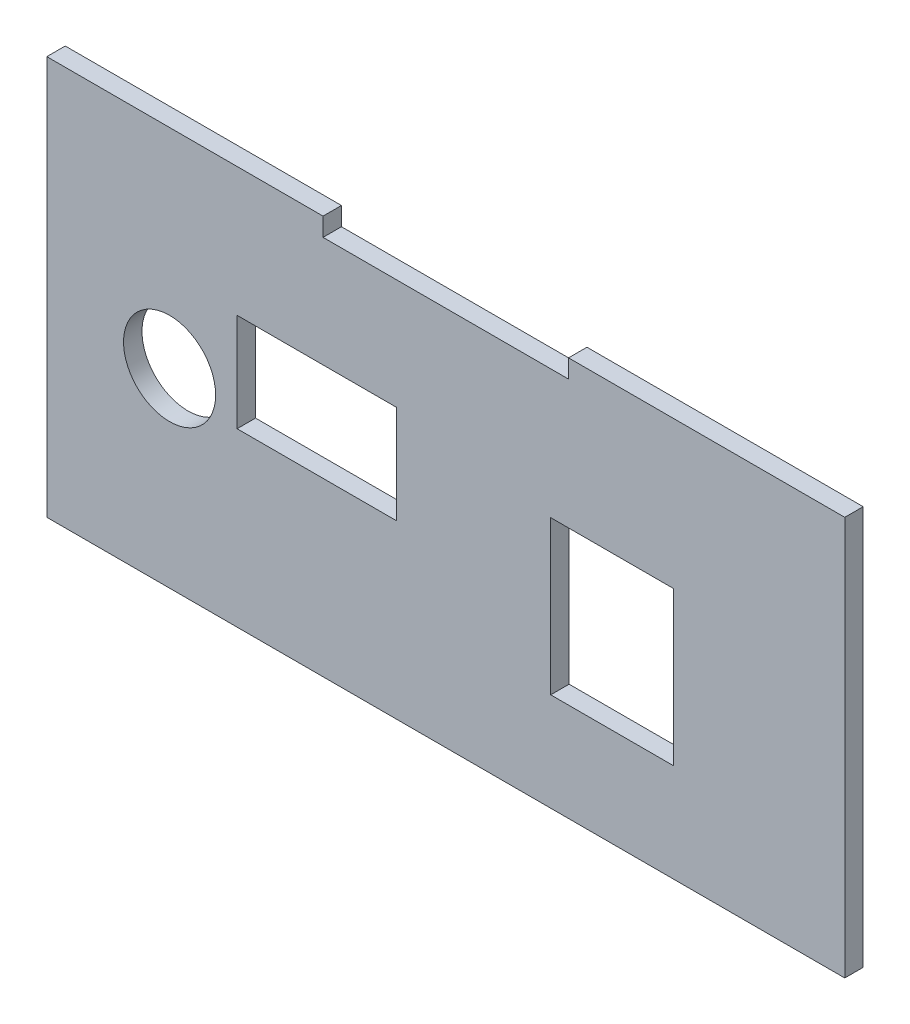
ISO-10303-21;
HEADER;
FILE_DESCRIPTION(('STEP AP214'),'2;1');
FILE_NAME('part.step','',(''),(''),'','','');
FILE_SCHEMA(('AUTOMOTIVE_DESIGN { 1 0 10303 214 1 1 1 1 }'));
ENDSEC;
DATA;
#1=APPLICATION_CONTEXT('core data for automotive mechanical design processes');
#2=APPLICATION_PROTOCOL_DEFINITION('international standard','automotive_design',2000,#1);
#3=PRODUCT_CONTEXT('',#1,'mechanical');
#4=PRODUCT('Part','Part','',(#3));
#5=PRODUCT_RELATED_PRODUCT_CATEGORY('part','',(#4));
#6=PRODUCT_DEFINITION_FORMATION('','',#4);
#7=PRODUCT_DEFINITION_CONTEXT('part definition',#1,'design');
#8=PRODUCT_DEFINITION('design','',#6,#7);
#9=PRODUCT_DEFINITION_SHAPE('','',#8);
#10=(LENGTH_UNIT() NAMED_UNIT(*) SI_UNIT(.MILLI.,.METRE.));
#11=(NAMED_UNIT(*) PLANE_ANGLE_UNIT() SI_UNIT($,.RADIAN.));
#12=(NAMED_UNIT(*) SI_UNIT($,.STERADIAN.) SOLID_ANGLE_UNIT());
#13=UNCERTAINTY_MEASURE_WITH_UNIT(LENGTH_MEASURE(1.E-05),#10,'distance_accuracy_value','');
#14=(GEOMETRIC_REPRESENTATION_CONTEXT(3) GLOBAL_UNCERTAINTY_ASSIGNED_CONTEXT((#13)) GLOBAL_UNIT_ASSIGNED_CONTEXT((#10,
#11,#12)) REPRESENTATION_CONTEXT('',''));
#15=CARTESIAN_POINT('',(0.,0.,0.));
#16=DIRECTION('',(0.,0.,1.));
#17=DIRECTION('',(1.,0.,0.));
#18=AXIS2_PLACEMENT_3D('',#15,#16,#17);
#19=CARTESIAN_POINT('',(0.,28.0440847360638,-3.));
#20=DIRECTION('',(0.,-1.,0.));
#21=DIRECTION('',(0.,0.,-1.));
#22=AXIS2_PLACEMENT_3D('',#19,#20,#21);
#23=PLANE('',#22);
#24=DIRECTION('',(1.,0.,0.));
#25=VECTOR('',#24,1.);
#26=CARTESIAN_POINT('',(0.,28.0440847360638,0.));
#27=LINE('',#26,#25);
#28=CARTESIAN_POINT('',(-64.0471321839935,28.0440847360638,0.));
#29=VERTEX_POINT('',#28);
#30=CARTESIAN_POINT('',(-38.0471321839935,28.0440847360638,0.));
#31=VERTEX_POINT('',#30);
#32=EDGE_CURVE('E239',#29,#31,#27,.T.);
#33=ORIENTED_EDGE('',*,*,#32,.F.);
#34=DIRECTION('',(0.,0.,1.));
#35=VECTOR('',#34,1.);
#36=CARTESIAN_POINT('',(-64.0471321839935,28.0440847360638,-3.));
#37=LINE('',#36,#35);
#38=CARTESIAN_POINT('',(-64.0471321839935,28.0440847360638,-3.));
#39=VERTEX_POINT('',#38);
#40=EDGE_CURVE('E11',#39,#29,#37,.T.);
#41=ORIENTED_EDGE('',*,*,#40,.F.);
#42=DIRECTION('',(1.,0.,0.));
#43=VECTOR('',#42,1.);
#44=CARTESIAN_POINT('',(0.,28.0440847360638,-3.));
#45=LINE('',#44,#43);
#46=CARTESIAN_POINT('',(-38.0471321839935,28.0440847360638,-3.));
#47=VERTEX_POINT('',#46);
#48=EDGE_CURVE('E182',#39,#47,#45,.T.);
#49=ORIENTED_EDGE('',*,*,#48,.T.);
#50=DIRECTION('',(0.,0.,1.));
#51=VECTOR('',#50,1.);
#52=CARTESIAN_POINT('',(-38.0471321839935,28.0440847360638,-3.));
#53=LINE('',#52,#51);
#54=EDGE_CURVE('E178',#47,#31,#53,.T.);
#55=ORIENTED_EDGE('',*,*,#54,.T.);
#56=EDGE_LOOP('',(#33,#41,#49,#55));
#57=FACE_BOUND('',#56,.T.);
#58=ADVANCED_FACE('F39',(#57),#23,.T.);
#59=CARTESIAN_POINT('',(-64.0471321839935,0.,-3.));
#60=DIRECTION('',(-1.,0.,0.));
#61=DIRECTION('',(0.,0.,1.));
#62=AXIS2_PLACEMENT_3D('',#59,#60,#61);
#63=PLANE('',#62);
#64=DIRECTION('',(0.,-1.,0.));
#65=VECTOR('',#64,1.);
#66=CARTESIAN_POINT('',(-64.0471321839935,0.,0.));
#67=LINE('',#66,#65);
#68=CARTESIAN_POINT('',(-64.0471321839935,12.0440847360638,0.));
#69=VERTEX_POINT('',#68);
#70=EDGE_CURVE('E248',#29,#69,#67,.T.);
#71=ORIENTED_EDGE('',*,*,#70,.T.);
#72=DIRECTION('',(0.,0.,1.));
#73=VECTOR('',#72,1.);
#74=CARTESIAN_POINT('',(-64.0471321839935,12.0440847360638,-3.));
#75=LINE('',#74,#73);
#76=CARTESIAN_POINT('',(-64.0471321839935,12.0440847360638,-3.));
#77=VERTEX_POINT('',#76);
#78=EDGE_CURVE('E50',#77,#69,#75,.T.);
#79=ORIENTED_EDGE('',*,*,#78,.F.);
#80=DIRECTION('',(0.,-1.,0.));
#81=VECTOR('',#80,1.);
#82=CARTESIAN_POINT('',(-64.0471321839935,0.,-3.));
#83=LINE('',#82,#81);
#84=EDGE_CURVE('E168',#39,#77,#83,.T.);
#85=ORIENTED_EDGE('',*,*,#84,.F.);
#86=ORIENTED_EDGE('',*,*,#40,.T.);
#87=EDGE_LOOP('',(#71,#79,#85,#86));
#88=FACE_BOUND('',#87,.T.);
#89=ADVANCED_FACE('F317',(#88),#63,.F.);
#90=CARTESIAN_POINT('',(0.,12.0440847360638,-3.));
#91=DIRECTION('',(0.,-1.,0.));
#92=DIRECTION('',(0.,0.,-1.));
#93=AXIS2_PLACEMENT_3D('',#90,#91,#92);
#94=PLANE('',#93);
#95=DIRECTION('',(1.,0.,0.));
#96=VECTOR('',#95,1.);
#97=CARTESIAN_POINT('',(0.,12.0440847360638,0.));
#98=LINE('',#97,#96);
#99=CARTESIAN_POINT('',(-38.0471321839935,12.0440847360638,0.));
#100=VERTEX_POINT('',#99);
#101=EDGE_CURVE('E111',#69,#100,#98,.T.);
#102=ORIENTED_EDGE('',*,*,#101,.T.);
#103=DIRECTION('',(0.,0.,1.));
#104=VECTOR('',#103,1.);
#105=CARTESIAN_POINT('',(-38.0471321839935,12.0440847360638,-3.));
#106=LINE('',#105,#104);
#107=CARTESIAN_POINT('',(-38.0471321839935,12.0440847360638,-3.));
#108=VERTEX_POINT('',#107);
#109=EDGE_CURVE('E173',#108,#100,#106,.T.);
#110=ORIENTED_EDGE('',*,*,#109,.F.);
#111=DIRECTION('',(1.,0.,0.));
#112=VECTOR('',#111,1.);
#113=CARTESIAN_POINT('',(0.,12.0440847360638,-3.));
#114=LINE('',#113,#112);
#115=EDGE_CURVE('E162',#77,#108,#114,.T.);
#116=ORIENTED_EDGE('',*,*,#115,.F.);
#117=ORIENTED_EDGE('',*,*,#78,.T.);
#118=EDGE_LOOP('',(#102,#110,#116,#117));
#119=FACE_BOUND('',#118,.T.);
#120=ADVANCED_FACE('F174',(#119),#94,.F.);
#121=CARTESIAN_POINT('',(0.,25.0440847360638,-3.));
#122=DIRECTION('',(0.,-1.,0.));
#123=DIRECTION('',(0.,0.,-1.));
#124=AXIS2_PLACEMENT_3D('',#121,#122,#123);
#125=PLANE('',#124);
#126=DIRECTION('',(1.,0.,0.));
#127=VECTOR('',#126,1.);
#128=CARTESIAN_POINT('',(0.,25.0440847360638,0.));
#129=LINE('',#128,#127);
#130=CARTESIAN_POINT('',(-12.9549310001956,25.0440847360638,0.));
#131=VERTEX_POINT('',#130);
#132=CARTESIAN_POINT('',(7.04506899980444,25.0440847360638,0.));
#133=VERTEX_POINT('',#132);
#134=EDGE_CURVE('E223',#131,#133,#129,.T.);
#135=ORIENTED_EDGE('',*,*,#134,.F.);
#136=DIRECTION('',(0.,0.,1.));
#137=VECTOR('',#136,1.);
#138=CARTESIAN_POINT('',(-12.9549310001956,25.0440847360638,-3.));
#139=LINE('',#138,#137);
#140=CARTESIAN_POINT('',(-12.9549310001956,25.0440847360638,-3.));
#141=VERTEX_POINT('',#140);
#142=EDGE_CURVE('E256',#141,#131,#139,.T.);
#143=ORIENTED_EDGE('',*,*,#142,.F.);
#144=DIRECTION('',(1.,0.,0.));
#145=VECTOR('',#144,1.);
#146=CARTESIAN_POINT('',(0.,25.0440847360638,-3.));
#147=LINE('',#146,#145);
#148=CARTESIAN_POINT('',(7.04506899980444,25.0440847360638,-3.));
#149=VERTEX_POINT('',#148);
#150=EDGE_CURVE('E398',#141,#149,#147,.T.);
#151=ORIENTED_EDGE('',*,*,#150,.T.);
#152=DIRECTION('',(0.,0.,1.));
#153=VECTOR('',#152,1.);
#154=CARTESIAN_POINT('',(7.04506899980444,25.0440847360638,-3.));
#155=LINE('',#154,#153);
#156=EDGE_CURVE('E266',#149,#133,#155,.T.);
#157=ORIENTED_EDGE('',*,*,#156,.T.);
#158=EDGE_LOOP('',(#135,#143,#151,#157));
#159=FACE_BOUND('',#158,.T.);
#160=ADVANCED_FACE('F330',(#159),#125,.T.);
#161=CARTESIAN_POINT('',(-12.9549310001956,0.,-3.));
#162=DIRECTION('',(-1.,0.,0.));
#163=DIRECTION('',(0.,-1.,0.));
#164=AXIS2_PLACEMENT_3D('',#161,#162,#163);
#165=PLANE('',#164);
#166=DIRECTION('',(0.,-1.,0.));
#167=VECTOR('',#166,1.);
#168=CARTESIAN_POINT('',(-12.9549310001956,0.,0.));
#169=LINE('',#168,#167);
#170=CARTESIAN_POINT('',(-12.9549310001956,0.0440847360638,0.));
#171=VERTEX_POINT('',#170);
#172=EDGE_CURVE('E235',#131,#171,#169,.T.);
#173=ORIENTED_EDGE('',*,*,#172,.T.);
#174=DIRECTION('',(0.,0.,1.));
#175=VECTOR('',#174,1.);
#176=CARTESIAN_POINT('',(-12.9549310001956,0.0440847360638,-3.));
#177=LINE('',#176,#175);
#178=CARTESIAN_POINT('',(-12.9549310001956,0.0440847360638,-3.));
#179=VERTEX_POINT('',#178);
#180=EDGE_CURVE('E259',#179,#171,#177,.T.);
#181=ORIENTED_EDGE('',*,*,#180,.F.);
#182=DIRECTION('',(0.,-1.,0.));
#183=VECTOR('',#182,1.);
#184=CARTESIAN_POINT('',(-12.9549310001956,0.,-3.));
#185=LINE('',#184,#183);
#186=EDGE_CURVE('E185',#141,#179,#185,.T.);
#187=ORIENTED_EDGE('',*,*,#186,.F.);
#188=ORIENTED_EDGE('',*,*,#142,.T.);
#189=EDGE_LOOP('',(#173,#181,#187,#188));
#190=FACE_BOUND('',#189,.T.);
#191=ADVANCED_FACE('F326',(#190),#165,.F.);
#192=CARTESIAN_POINT('',(0.,0.0440847360638,-3.));
#193=DIRECTION('',(0.,-1.,0.));
#194=DIRECTION('',(0.,0.,-1.));
#195=AXIS2_PLACEMENT_3D('',#192,#193,#194);
#196=PLANE('',#195);
#197=DIRECTION('',(1.,0.,0.));
#198=VECTOR('',#197,1.);
#199=CARTESIAN_POINT('',(0.,0.0440847360638,0.));
#200=LINE('',#199,#198);
#201=CARTESIAN_POINT('',(7.04506899980445,0.0440847360638,0.));
#202=VERTEX_POINT('',#201);
#203=EDGE_CURVE('E231',#171,#202,#200,.T.);
#204=ORIENTED_EDGE('',*,*,#203,.T.);
#205=DIRECTION('',(0.,0.,1.));
#206=VECTOR('',#205,1.);
#207=CARTESIAN_POINT('',(7.04506899980445,0.0440847360638,-3.));
#208=LINE('',#207,#206);
#209=CARTESIAN_POINT('',(7.04506899980445,0.0440847360638,-3.));
#210=VERTEX_POINT('',#209);
#211=EDGE_CURVE('E263',#210,#202,#208,.T.);
#212=ORIENTED_EDGE('',*,*,#211,.F.);
#213=DIRECTION('',(1.,0.,0.));
#214=VECTOR('',#213,1.);
#215=CARTESIAN_POINT('',(0.,0.0440847360638,-3.));
#216=LINE('',#215,#214);
#217=EDGE_CURVE('E406',#179,#210,#216,.T.);
#218=ORIENTED_EDGE('',*,*,#217,.F.);
#219=ORIENTED_EDGE('',*,*,#180,.T.);
#220=EDGE_LOOP('',(#204,#212,#218,#219));
#221=FACE_BOUND('',#220,.T.);
#222=ADVANCED_FACE('F329',(#221),#196,.F.);
#223=CARTESIAN_POINT('',(0.,49.0440847360638,-3.));
#224=DIRECTION('',(0.,-1.,0.));
#225=DIRECTION('',(0.,0.,-1.));
#226=AXIS2_PLACEMENT_3D('',#223,#224,#225);
#227=PLANE('',#226);
#228=DIRECTION('',(1.,0.,0.));
#229=VECTOR('',#228,1.);
#230=CARTESIAN_POINT('',(0.,49.0440847360638,0.));
#231=LINE('',#230,#229);
#232=CARTESIAN_POINT('',(-10.0471321839935,49.0440847360638,0.));
#233=VERTEX_POINT('',#232);
#234=CARTESIAN_POINT('',(34.9528678160065,49.0440847360638,0.));
#235=VERTEX_POINT('',#234);
#236=EDGE_CURVE('E195',#233,#235,#231,.T.);
#237=ORIENTED_EDGE('',*,*,#236,.T.);
#238=DIRECTION('',(0.,0.,1.));
#239=VECTOR('',#238,1.);
#240=CARTESIAN_POINT('',(34.9528678160065,49.0440847360638,-3.));
#241=LINE('',#240,#239);
#242=CARTESIAN_POINT('',(34.9528678160065,49.0440847360638,-3.));
#243=VERTEX_POINT('',#242);
#244=EDGE_CURVE('E269',#243,#235,#241,.T.);
#245=ORIENTED_EDGE('',*,*,#244,.F.);
#246=DIRECTION('',(1.,0.,0.));
#247=VECTOR('',#246,1.);
#248=CARTESIAN_POINT('',(0.,49.0440847360638,-3.));
#249=LINE('',#248,#247);
#250=CARTESIAN_POINT('',(-10.0471321839935,49.0440847360638,-3.));
#251=VERTEX_POINT('',#250);
#252=EDGE_CURVE('E298',#251,#243,#249,.T.);
#253=ORIENTED_EDGE('',*,*,#252,.F.);
#254=DIRECTION('',(0.,0.,1.));
#255=VECTOR('',#254,1.);
#256=CARTESIAN_POINT('',(-10.0471321839935,49.0440847360638,-3.));
#257=LINE('',#256,#255);
#258=EDGE_CURVE('E43',#251,#233,#257,.T.);
#259=ORIENTED_EDGE('',*,*,#258,.T.);
#260=EDGE_LOOP('',(#237,#245,#253,#259));
#261=FACE_BOUND('',#260,.T.);
#262=ADVANCED_FACE('F295',(#261),#227,.F.);
#263=CARTESIAN_POINT('',(34.9528678160065,0.,-3.));
#264=DIRECTION('',(-1.,0.,0.));
#265=DIRECTION('',(0.,-1.,0.));
#266=AXIS2_PLACEMENT_3D('',#263,#264,#265);
#267=PLANE('',#266);
#268=DIRECTION('',(0.,-1.,0.));
#269=VECTOR('',#268,1.);
#270=CARTESIAN_POINT('',(34.9528678160065,0.,0.));
#271=LINE('',#270,#269);
#272=CARTESIAN_POINT('',(34.9528678160065,-15.9559152639362,0.));
#273=VERTEX_POINT('',#272);
#274=EDGE_CURVE('E219',#235,#273,#271,.T.);
#275=ORIENTED_EDGE('',*,*,#274,.T.);
#276=DIRECTION('',(0.,0.,1.));
#277=VECTOR('',#276,1.);
#278=CARTESIAN_POINT('',(34.9528678160065,-15.9559152639362,-3.));
#279=LINE('',#278,#277);
#280=CARTESIAN_POINT('',(34.9528678160065,-15.9559152639362,-3.));
#281=VERTEX_POINT('',#280);
#282=EDGE_CURVE('E273',#281,#273,#279,.T.);
#283=ORIENTED_EDGE('',*,*,#282,.F.);
#284=DIRECTION('',(0.,-1.,0.));
#285=VECTOR('',#284,1.);
#286=CARTESIAN_POINT('',(34.9528678160065,0.,-3.));
#287=LINE('',#286,#285);
#288=EDGE_CURVE('E395',#243,#281,#287,.T.);
#289=ORIENTED_EDGE('',*,*,#288,.F.);
#290=ORIENTED_EDGE('',*,*,#244,.T.);
#291=EDGE_LOOP('',(#275,#283,#289,#290));
#292=FACE_BOUND('',#291,.T.);
#293=ADVANCED_FACE('F338',(#292),#267,.F.);
#294=CARTESIAN_POINT('',(0.,-15.9559152639362,-3.));
#295=DIRECTION('',(0.,-1.,0.));
#296=DIRECTION('',(0.,0.,-1.));
#297=AXIS2_PLACEMENT_3D('',#294,#295,#296);
#298=PLANE('',#297);
#299=DIRECTION('',(1.,0.,0.));
#300=VECTOR('',#299,1.);
#301=CARTESIAN_POINT('',(0.,-15.9559152639362,0.));
#302=LINE('',#301,#300);
#303=CARTESIAN_POINT('',(-95.0471321839935,-15.9559152639362,0.));
#304=VERTEX_POINT('',#303);
#305=EDGE_CURVE('E215',#304,#273,#302,.T.);
#306=ORIENTED_EDGE('',*,*,#305,.F.);
#307=DIRECTION('',(0.,0.,1.));
#308=VECTOR('',#307,1.);
#309=CARTESIAN_POINT('',(-95.0471321839935,-15.9559152639362,-3.));
#310=LINE('',#309,#308);
#311=CARTESIAN_POINT('',(-95.0471321839935,-15.9559152639362,-3.));
#312=VERTEX_POINT('',#311);
#313=EDGE_CURVE('E276',#312,#304,#310,.T.);
#314=ORIENTED_EDGE('',*,*,#313,.F.);
#315=DIRECTION('',(1.,0.,0.));
#316=VECTOR('',#315,1.);
#317=CARTESIAN_POINT('',(0.,-15.9559152639362,-3.));
#318=LINE('',#317,#316);
#319=EDGE_CURVE('E391',#312,#281,#318,.T.);
#320=ORIENTED_EDGE('',*,*,#319,.T.);
#321=ORIENTED_EDGE('',*,*,#282,.T.);
#322=EDGE_LOOP('',(#306,#314,#320,#321));
#323=FACE_BOUND('',#322,.T.);
#324=ADVANCED_FACE('F341',(#323),#298,.T.);
#325=CARTESIAN_POINT('',(-95.0471321839935,0.,-3.));
#326=DIRECTION('',(-1.,0.,0.));
#327=DIRECTION('',(0.,-1.,0.));
#328=AXIS2_PLACEMENT_3D('',#325,#326,#327);
#329=PLANE('',#328);
#330=DIRECTION('',(0.,-1.,0.));
#331=VECTOR('',#330,1.);
#332=CARTESIAN_POINT('',(-95.0471321839935,0.,0.));
#333=LINE('',#332,#331);
#334=CARTESIAN_POINT('',(-95.0471321839936,49.0440847360638,0.));
#335=VERTEX_POINT('',#334);
#336=EDGE_CURVE('E211',#335,#304,#333,.T.);
#337=ORIENTED_EDGE('',*,*,#336,.F.);
#338=DIRECTION('',(0.,0.,1.));
#339=VECTOR('',#338,1.);
#340=CARTESIAN_POINT('',(-95.0471321839936,49.0440847360638,-3.));
#341=LINE('',#340,#339);
#342=CARTESIAN_POINT('',(-95.0471321839936,49.0440847360638,-3.));
#343=VERTEX_POINT('',#342);
#344=EDGE_CURVE('E279',#343,#335,#341,.T.);
#345=ORIENTED_EDGE('',*,*,#344,.F.);
#346=DIRECTION('',(0.,-1.,0.));
#347=VECTOR('',#346,1.);
#348=CARTESIAN_POINT('',(-95.0471321839935,0.,-3.));
#349=LINE('',#348,#347);
#350=EDGE_CURVE('E388',#343,#312,#349,.T.);
#351=ORIENTED_EDGE('',*,*,#350,.T.);
#352=ORIENTED_EDGE('',*,*,#313,.T.);
#353=EDGE_LOOP('',(#337,#345,#351,#352));
#354=FACE_BOUND('',#353,.T.);
#355=ADVANCED_FACE('F345',(#354),#329,.T.);
#356=CARTESIAN_POINT('',(-50.0471321839935,49.0440847360638,0.));
#357=VERTEX_POINT('',#356);
#358=EDGE_CURVE('E200',#335,#357,#231,.T.);
#359=ORIENTED_EDGE('',*,*,#358,.T.);
#360=DIRECTION('',(0.,0.,1.));
#361=VECTOR('',#360,1.);
#362=CARTESIAN_POINT('',(-50.0471321839935,49.0440847360638,-3.));
#363=LINE('',#362,#361);
#364=CARTESIAN_POINT('',(-50.0471321839935,49.0440847360638,-3.));
#365=VERTEX_POINT('',#364);
#366=EDGE_CURVE('E282',#365,#357,#363,.T.);
#367=ORIENTED_EDGE('',*,*,#366,.F.);
#368=EDGE_CURVE('E370',#343,#365,#249,.T.);
#369=ORIENTED_EDGE('',*,*,#368,.F.);
#370=ORIENTED_EDGE('',*,*,#344,.T.);
#371=EDGE_LOOP('',(#359,#367,#369,#370));
#372=FACE_BOUND('',#371,.T.);
#373=ADVANCED_FACE('F349',(#372),#227,.F.);
#374=CARTESIAN_POINT('',(-50.0471321839935,0.,-3.));
#375=DIRECTION('',(-1.,0.,0.));
#376=DIRECTION('',(0.,0.,1.));
#377=AXIS2_PLACEMENT_3D('',#374,#375,#376);
#378=PLANE('',#377);
#379=DIRECTION('',(0.,-1.,0.));
#380=VECTOR('',#379,1.);
#381=CARTESIAN_POINT('',(-50.0471321839935,0.,0.));
#382=LINE('',#381,#380);
#383=CARTESIAN_POINT('',(-50.0471321839935,46.0440847360638,0.));
#384=VERTEX_POINT('',#383);
#385=EDGE_CURVE('E208',#357,#384,#382,.T.);
#386=ORIENTED_EDGE('',*,*,#385,.T.);
#387=DIRECTION('',(0.,0.,1.));
#388=VECTOR('',#387,1.);
#389=CARTESIAN_POINT('',(-50.0471321839935,46.0440847360638,-3.));
#390=LINE('',#389,#388);
#391=CARTESIAN_POINT('',(-50.0471321839935,46.0440847360638,-3.));
#392=VERTEX_POINT('',#391);
#393=EDGE_CURVE('E286',#392,#384,#390,.T.);
#394=ORIENTED_EDGE('',*,*,#393,.F.);
#395=DIRECTION('',(0.,-1.,0.));
#396=VECTOR('',#395,1.);
#397=CARTESIAN_POINT('',(-50.0471321839935,0.,-3.));
#398=LINE('',#397,#396);
#399=EDGE_CURVE('E368',#365,#392,#398,.T.);
#400=ORIENTED_EDGE('',*,*,#399,.F.);
#401=ORIENTED_EDGE('',*,*,#366,.T.);
#402=EDGE_LOOP('',(#386,#394,#400,#401));
#403=FACE_BOUND('',#402,.T.);
#404=ADVANCED_FACE('F353',(#403),#378,.F.);
#405=CARTESIAN_POINT('',(0.,46.0440847360638,-3.));
#406=DIRECTION('',(0.,-1.,0.));
#407=DIRECTION('',(0.,0.,-1.));
#408=AXIS2_PLACEMENT_3D('',#405,#406,#407);
#409=PLANE('',#408);
#410=DIRECTION('',(1.,0.,0.));
#411=VECTOR('',#410,1.);
#412=CARTESIAN_POINT('',(0.,46.0440847360638,0.));
#413=LINE('',#412,#411);
#414=CARTESIAN_POINT('',(-10.0471321839935,46.0440847360638,0.));
#415=VERTEX_POINT('',#414);
#416=EDGE_CURVE('E204',#384,#415,#413,.T.);
#417=ORIENTED_EDGE('',*,*,#416,.T.);
#418=DIRECTION('',(0.,0.,1.));
#419=VECTOR('',#418,1.);
#420=CARTESIAN_POINT('',(-10.0471321839935,46.0440847360638,-3.));
#421=LINE('',#420,#419);
#422=CARTESIAN_POINT('',(-10.0471321839935,46.0440847360638,-3.));
#423=VERTEX_POINT('',#422);
#424=EDGE_CURVE('E289',#423,#415,#421,.T.);
#425=ORIENTED_EDGE('',*,*,#424,.F.);
#426=DIRECTION('',(1.,0.,0.));
#427=VECTOR('',#426,1.);
#428=CARTESIAN_POINT('',(0.,46.0440847360638,-3.));
#429=LINE('',#428,#427);
#430=EDGE_CURVE('E381',#392,#423,#429,.T.);
#431=ORIENTED_EDGE('',*,*,#430,.F.);
#432=ORIENTED_EDGE('',*,*,#393,.T.);
#433=EDGE_LOOP('',(#417,#425,#431,#432));
#434=FACE_BOUND('',#433,.T.);
#435=ADVANCED_FACE('F312',(#434),#409,.F.);
#436=CARTESIAN_POINT('',(7.04506899980445,0.,-3.));
#437=DIRECTION('',(-1.,0.,0.));
#438=DIRECTION('',(0.,-1.,0.));
#439=AXIS2_PLACEMENT_3D('',#436,#437,#438);
#440=PLANE('',#439);
#441=DIRECTION('',(0.,-1.,0.));
#442=VECTOR('',#441,1.);
#443=CARTESIAN_POINT('',(7.04506899980445,0.,0.));
#444=LINE('',#443,#442);
#445=EDGE_CURVE('E227',#133,#202,#444,.T.);
#446=ORIENTED_EDGE('',*,*,#445,.F.);
#447=ORIENTED_EDGE('',*,*,#156,.F.);
#448=DIRECTION('',(0.,-1.,0.));
#449=VECTOR('',#448,1.);
#450=CARTESIAN_POINT('',(7.04506899980445,0.,-3.));
#451=LINE('',#450,#449);
#452=EDGE_CURVE('E402',#149,#210,#451,.T.);
#453=ORIENTED_EDGE('',*,*,#452,.T.);
#454=ORIENTED_EDGE('',*,*,#211,.T.);
#455=EDGE_LOOP('',(#446,#447,#453,#454));
#456=FACE_BOUND('',#455,.T.);
#457=ADVANCED_FACE('F306',(#456),#440,.T.);
#458=CARTESIAN_POINT('',(-10.0471321839935,0.,-3.));
#459=DIRECTION('',(-1.,0.,0.));
#460=DIRECTION('',(0.,0.,1.));
#461=AXIS2_PLACEMENT_3D('',#458,#459,#460);
#462=PLANE('',#461);
#463=DIRECTION('',(0.,-1.,0.));
#464=VECTOR('',#463,1.);
#465=CARTESIAN_POINT('',(-10.0471321839935,0.,0.));
#466=LINE('',#465,#464);
#467=EDGE_CURVE('E199',#233,#415,#466,.T.);
#468=ORIENTED_EDGE('',*,*,#467,.F.);
#469=ORIENTED_EDGE('',*,*,#258,.F.);
#470=DIRECTION('',(0.,-1.,0.));
#471=VECTOR('',#470,1.);
#472=CARTESIAN_POINT('',(-10.0471321839935,0.,-3.));
#473=LINE('',#472,#471);
#474=EDGE_CURVE('E378',#251,#423,#473,.T.);
#475=ORIENTED_EDGE('',*,*,#474,.T.);
#476=ORIENTED_EDGE('',*,*,#424,.T.);
#477=EDGE_LOOP('',(#468,#469,#475,#476));
#478=FACE_BOUND('',#477,.T.);
#479=ADVANCED_FACE('F304',(#478),#462,.T.);
#480=CARTESIAN_POINT('',(-75.0471321839935,15.0440847360638,-3.));
#481=DIRECTION('',(0.,0.,1.));
#482=DIRECTION('',(1.,0.,0.));
#483=AXIS2_PLACEMENT_3D('',#480,#481,#482);
#484=CYLINDRICAL_SURFACE('',#483,7.5);
#485=CARTESIAN_POINT('',(-75.0471321839935,15.0440847360638,-3.));
#486=DIRECTION('',(0.,0.,1.));
#487=DIRECTION('',(1.,0.,0.));
#488=AXIS2_PLACEMENT_3D('',#485,#486,#487);
#489=CIRCLE('',#488,7.5);
#490=CARTESIAN_POINT('',(-67.5471321839935,15.0440847360638,-3.));
#491=VERTEX_POINT('',#490);
#492=EDGE_CURVE('E250',#491,#491,#489,.T.);
#493=ORIENTED_EDGE('',*,*,#492,.F.);
#494=EDGE_LOOP('',(#493));
#495=FACE_BOUND('',#494,.T.);
#496=CARTESIAN_POINT('',(-75.0471321839935,15.0440847360638,0.));
#497=DIRECTION('',(0.,0.,1.));
#498=DIRECTION('',(1.,0.,0.));
#499=AXIS2_PLACEMENT_3D('',#496,#497,#498);
#500=CIRCLE('',#499,7.5);
#501=CARTESIAN_POINT('',(-67.5471321839935,15.0440847360638,0.));
#502=VERTEX_POINT('',#501);
#503=EDGE_CURVE('E191',#502,#502,#500,.T.);
#504=ORIENTED_EDGE('',*,*,#503,.T.);
#505=EDGE_LOOP('',(#504));
#506=FACE_BOUND('',#505,.T.);
#507=ADVANCED_FACE('F41',(#495,#506),#484,.F.);
#508=CARTESIAN_POINT('',(-38.0471321839935,0.,-3.));
#509=DIRECTION('',(-1.,0.,0.));
#510=DIRECTION('',(0.,-1.,0.));
#511=AXIS2_PLACEMENT_3D('',#508,#509,#510);
#512=PLANE('',#511);
#513=DIRECTION('',(0.,-1.,0.));
#514=VECTOR('',#513,1.);
#515=CARTESIAN_POINT('',(-38.0471321839935,0.,0.));
#516=LINE('',#515,#514);
#517=EDGE_CURVE('E243',#31,#100,#516,.T.);
#518=ORIENTED_EDGE('',*,*,#517,.F.);
#519=ORIENTED_EDGE('',*,*,#54,.F.);
#520=DIRECTION('',(0.,-1.,0.));
#521=VECTOR('',#520,1.);
#522=CARTESIAN_POINT('',(-38.0471321839935,0.,-3.));
#523=LINE('',#522,#521);
#524=EDGE_CURVE('E167',#47,#108,#523,.T.);
#525=ORIENTED_EDGE('',*,*,#524,.T.);
#526=ORIENTED_EDGE('',*,*,#109,.T.);
#527=EDGE_LOOP('',(#518,#519,#525,#526));
#528=FACE_BOUND('',#527,.T.);
#529=ADVANCED_FACE('F180',(#528),#512,.T.);
#530=CARTESIAN_POINT('',(0.,0.,-3.));
#531=DIRECTION('',(0.,0.,1.));
#532=DIRECTION('',(1.,0.,0.));
#533=AXIS2_PLACEMENT_3D('',#530,#531,#532);
#534=PLANE('',#533);
#535=ORIENTED_EDGE('',*,*,#492,.T.);
#536=EDGE_LOOP('',(#535));
#537=FACE_BOUND('',#536,.T.);
#538=ORIENTED_EDGE('',*,*,#252,.T.);
#539=ORIENTED_EDGE('',*,*,#288,.T.);
#540=ORIENTED_EDGE('',*,*,#319,.F.);
#541=ORIENTED_EDGE('',*,*,#350,.F.);
#542=ORIENTED_EDGE('',*,*,#368,.T.);
#543=ORIENTED_EDGE('',*,*,#399,.T.);
#544=ORIENTED_EDGE('',*,*,#430,.T.);
#545=ORIENTED_EDGE('',*,*,#474,.F.);
#546=EDGE_LOOP('',(#538,#539,#540,#541,#542,#543,#544,#545));
#547=FACE_BOUND('',#546,.T.);
#548=ORIENTED_EDGE('',*,*,#150,.F.);
#549=ORIENTED_EDGE('',*,*,#186,.T.);
#550=ORIENTED_EDGE('',*,*,#217,.T.);
#551=ORIENTED_EDGE('',*,*,#452,.F.);
#552=EDGE_LOOP('',(#548,#549,#550,#551));
#553=FACE_BOUND('',#552,.T.);
#554=ORIENTED_EDGE('',*,*,#48,.F.);
#555=ORIENTED_EDGE('',*,*,#84,.T.);
#556=ORIENTED_EDGE('',*,*,#115,.T.);
#557=ORIENTED_EDGE('',*,*,#524,.F.);
#558=EDGE_LOOP('',(#554,#555,#556,#557));
#559=FACE_BOUND('',#558,.T.);
#560=ADVANCED_FACE('F165',(#537,#547,#553,#559),#534,.F.);
#561=CARTESIAN_POINT('',(0.,0.,0.));
#562=DIRECTION('',(0.,0.,1.));
#563=DIRECTION('',(1.,0.,0.));
#564=AXIS2_PLACEMENT_3D('',#561,#562,#563);
#565=PLANE('',#564);
#566=ORIENTED_EDGE('',*,*,#503,.F.);
#567=EDGE_LOOP('',(#566));
#568=FACE_BOUND('',#567,.T.);
#569=ORIENTED_EDGE('',*,*,#236,.F.);
#570=ORIENTED_EDGE('',*,*,#467,.T.);
#571=ORIENTED_EDGE('',*,*,#416,.F.);
#572=ORIENTED_EDGE('',*,*,#385,.F.);
#573=ORIENTED_EDGE('',*,*,#358,.F.);
#574=ORIENTED_EDGE('',*,*,#336,.T.);
#575=ORIENTED_EDGE('',*,*,#305,.T.);
#576=ORIENTED_EDGE('',*,*,#274,.F.);
#577=EDGE_LOOP('',(#569,#570,#571,#572,#573,#574,#575,#576));
#578=FACE_BOUND('',#577,.T.);
#579=ORIENTED_EDGE('',*,*,#134,.T.);
#580=ORIENTED_EDGE('',*,*,#445,.T.);
#581=ORIENTED_EDGE('',*,*,#203,.F.);
#582=ORIENTED_EDGE('',*,*,#172,.F.);
#583=EDGE_LOOP('',(#579,#580,#581,#582));
#584=FACE_BOUND('',#583,.T.);
#585=ORIENTED_EDGE('',*,*,#32,.T.);
#586=ORIENTED_EDGE('',*,*,#517,.T.);
#587=ORIENTED_EDGE('',*,*,#101,.F.);
#588=ORIENTED_EDGE('',*,*,#70,.F.);
#589=EDGE_LOOP('',(#585,#586,#587,#588));
#590=FACE_BOUND('',#589,.T.);
#591=ADVANCED_FACE('F301',(#568,#578,#584,#590),#565,.T.);
#592=CLOSED_SHELL('',(#58,#89,#120,#160,#191,#222,#262,#293,#324,#355,#373,#404,#435,#457,#479,
#507,#529,#560,#591));
#593=MANIFOLD_SOLID_BREP('B2',#592);
#594=ADVANCED_BREP_SHAPE_REPRESENTATION('',(#18,#593),#14);
#595=SHAPE_DEFINITION_REPRESENTATION(#9,#594);
ENDSEC;
END-ISO-10303-21;
